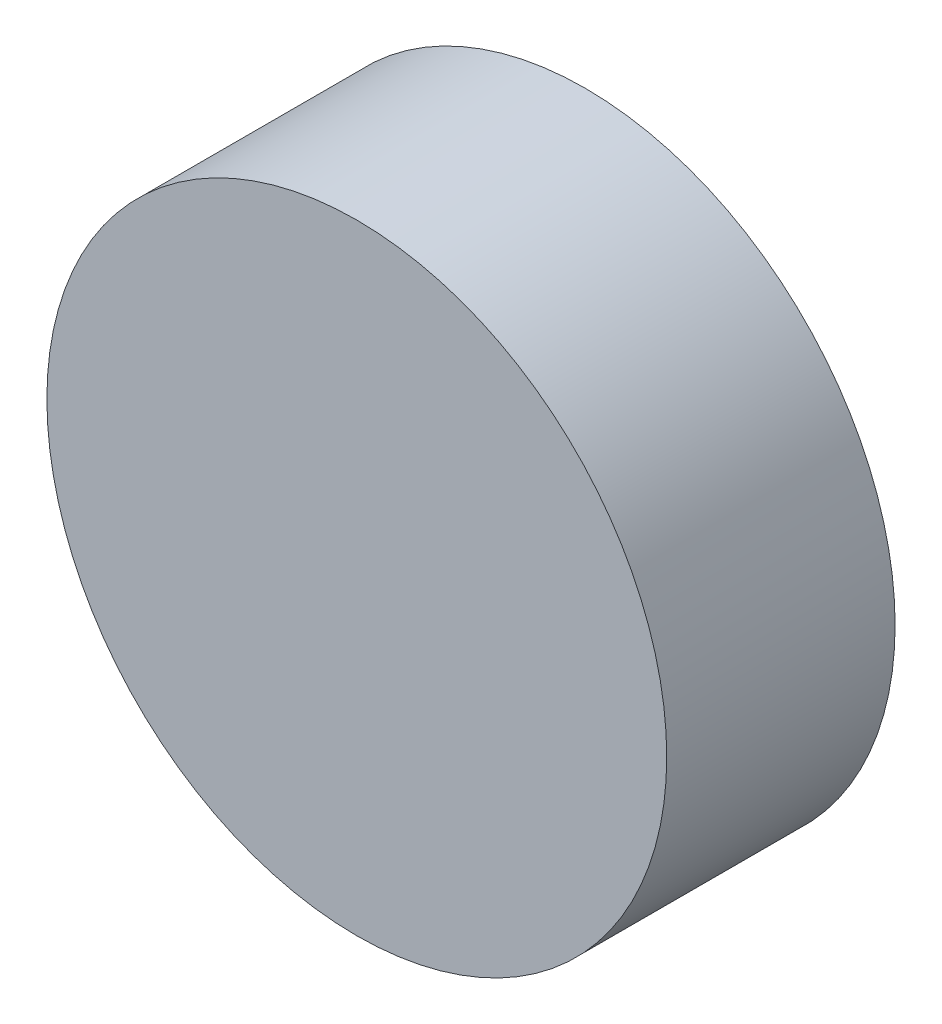
ISO-10303-21;
HEADER;
FILE_DESCRIPTION(('STEP AP214'),'2;1');
FILE_NAME('part.step','',(''),(''),'','','');
FILE_SCHEMA(('AUTOMOTIVE_DESIGN { 1 0 10303 214 1 1 1 1 }'));
ENDSEC;
DATA;
#1=APPLICATION_CONTEXT('core data for automotive mechanical design processes');
#2=APPLICATION_PROTOCOL_DEFINITION('international standard','automotive_design',2000,#1);
#3=PRODUCT_CONTEXT('',#1,'mechanical');
#4=PRODUCT('Part','Part','',(#3));
#5=PRODUCT_RELATED_PRODUCT_CATEGORY('part','',(#4));
#6=PRODUCT_DEFINITION_FORMATION('','',#4);
#7=PRODUCT_DEFINITION_CONTEXT('part definition',#1,'design');
#8=PRODUCT_DEFINITION('design','',#6,#7);
#9=PRODUCT_DEFINITION_SHAPE('','',#8);
#10=(LENGTH_UNIT() NAMED_UNIT(*) SI_UNIT(.MILLI.,.METRE.));
#11=(NAMED_UNIT(*) PLANE_ANGLE_UNIT() SI_UNIT($,.RADIAN.));
#12=(NAMED_UNIT(*) SI_UNIT($,.STERADIAN.) SOLID_ANGLE_UNIT());
#13=UNCERTAINTY_MEASURE_WITH_UNIT(LENGTH_MEASURE(1.E-05),#10,'distance_accuracy_value','');
#14=(GEOMETRIC_REPRESENTATION_CONTEXT(3) GLOBAL_UNCERTAINTY_ASSIGNED_CONTEXT((#13)) GLOBAL_UNIT_ASSIGNED_CONTEXT((#10,
#11,#12)) REPRESENTATION_CONTEXT('',''));
#15=CARTESIAN_POINT('',(0.,0.,0.));
#16=DIRECTION('',(0.,0.,1.));
#17=DIRECTION('',(1.,0.,0.));
#18=AXIS2_PLACEMENT_3D('',#15,#16,#17);
#19=CARTESIAN_POINT('',(0.,0.,14.));
#20=DIRECTION('',(0.,0.,-1.));
#21=DIRECTION('',(-1.,0.,0.));
#22=AXIS2_PLACEMENT_3D('',#19,#20,#21);
#23=CYLINDRICAL_SURFACE('',#22,19.);
#24=CARTESIAN_POINT('',(0.,0.,14.));
#25=DIRECTION('',(0.,0.,1.));
#26=DIRECTION('',(1.,0.,0.));
#27=AXIS2_PLACEMENT_3D('',#24,#25,#26);
#28=CIRCLE('',#27,19.);
#29=CARTESIAN_POINT('',(19.,0.,14.));
#30=VERTEX_POINT('',#29);
#31=EDGE_CURVE('E10',#30,#30,#28,.T.);
#32=ORIENTED_EDGE('',*,*,#31,.F.);
#33=EDGE_LOOP('',(#32));
#34=FACE_BOUND('',#33,.T.);
#35=CARTESIAN_POINT('',(0.,0.,0.));
#36=DIRECTION('',(0.,0.,1.));
#37=DIRECTION('',(1.,0.,0.));
#38=AXIS2_PLACEMENT_3D('',#35,#36,#37);
#39=CIRCLE('',#38,19.);
#40=CARTESIAN_POINT('',(19.,0.,0.));
#41=VERTEX_POINT('',#40);
#42=EDGE_CURVE('E44',#41,#41,#39,.T.);
#43=ORIENTED_EDGE('',*,*,#42,.T.);
#44=EDGE_LOOP('',(#43));
#45=FACE_BOUND('',#44,.T.);
#46=ADVANCED_FACE('F41',(#34,#45),#23,.T.);
#47=CARTESIAN_POINT('',(0.,0.,14.));
#48=DIRECTION('',(0.,0.,1.));
#49=DIRECTION('',(1.,0.,0.));
#50=AXIS2_PLACEMENT_3D('',#47,#48,#49);
#51=PLANE('',#50);
#52=ORIENTED_EDGE('',*,*,#31,.T.);
#53=EDGE_LOOP('',(#52));
#54=FACE_BOUND('',#53,.T.);
#55=ADVANCED_FACE('F58',(#54),#51,.T.);
#56=CARTESIAN_POINT('',(0.,0.,0.));
#57=DIRECTION('',(0.,0.,1.));
#58=DIRECTION('',(1.,0.,0.));
#59=AXIS2_PLACEMENT_3D('',#56,#57,#58);
#60=PLANE('',#59);
#61=ORIENTED_EDGE('',*,*,#42,.F.);
#62=EDGE_LOOP('',(#61));
#63=FACE_BOUND('',#62,.T.);
#64=ADVANCED_FACE('F56',(#63),#60,.F.);
#65=CLOSED_SHELL('',(#46,#55,#64));
#66=MANIFOLD_SOLID_BREP('B2',#65);
#67=ADVANCED_BREP_SHAPE_REPRESENTATION('',(#18,#66),#14);
#68=SHAPE_DEFINITION_REPRESENTATION(#9,#67);
ENDSEC;
END-ISO-10303-21;
